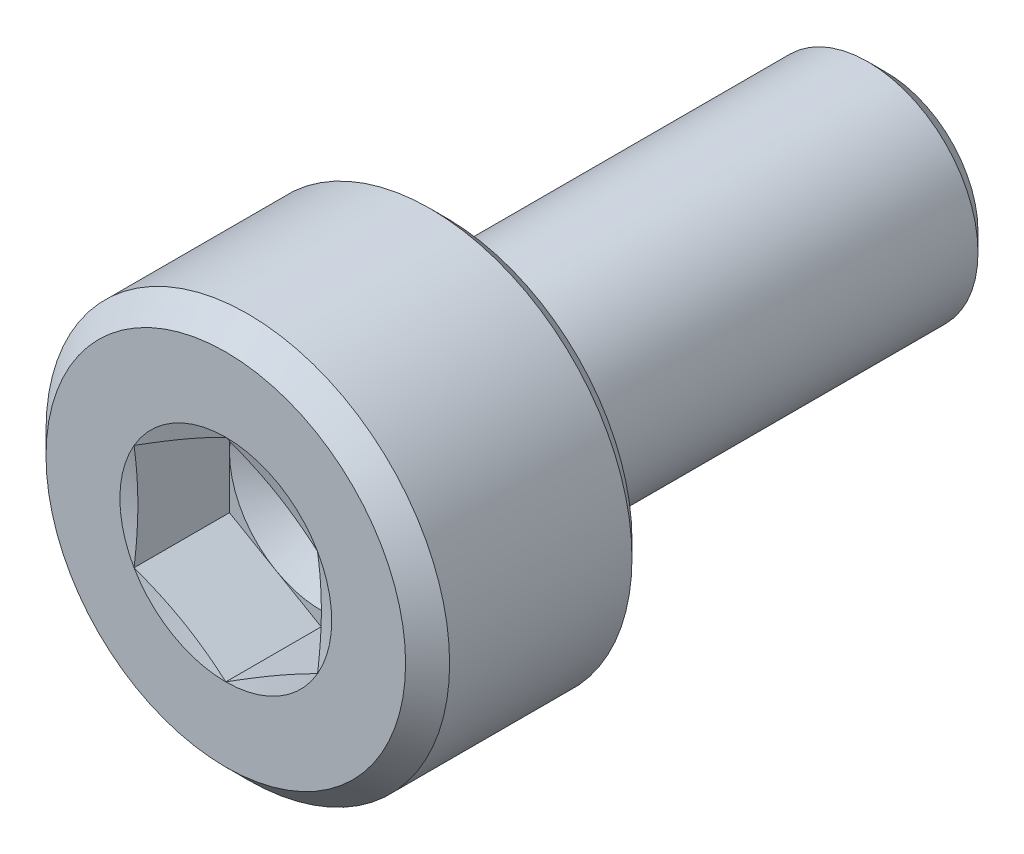
ISO-10303-21;
HEADER;
FILE_DESCRIPTION(('STEP AP214'),'2;1');
FILE_NAME('part.step','',(''),(''),'','','');
FILE_SCHEMA(('AUTOMOTIVE_DESIGN { 1 0 10303 214 1 1 1 1 }'));
ENDSEC;
DATA;
#1=APPLICATION_CONTEXT('core data for automotive mechanical design processes');
#2=APPLICATION_PROTOCOL_DEFINITION('international standard','automotive_design',2000,#1);
#3=PRODUCT_CONTEXT('',#1,'mechanical');
#4=PRODUCT('Part','Part','',(#3));
#5=PRODUCT_RELATED_PRODUCT_CATEGORY('part','',(#4));
#6=PRODUCT_DEFINITION_FORMATION('','',#4);
#7=PRODUCT_DEFINITION_CONTEXT('part definition',#1,'design');
#8=PRODUCT_DEFINITION('design','',#6,#7);
#9=PRODUCT_DEFINITION_SHAPE('','',#8);
#10=(LENGTH_UNIT() NAMED_UNIT(*) SI_UNIT(.MILLI.,.METRE.));
#11=(NAMED_UNIT(*) PLANE_ANGLE_UNIT() SI_UNIT($,.RADIAN.));
#12=(NAMED_UNIT(*) SI_UNIT($,.STERADIAN.) SOLID_ANGLE_UNIT());
#13=UNCERTAINTY_MEASURE_WITH_UNIT(LENGTH_MEASURE(1.E-05),#10,'distance_accuracy_value','');
#14=(GEOMETRIC_REPRESENTATION_CONTEXT(3) GLOBAL_UNCERTAINTY_ASSIGNED_CONTEXT((#13)) GLOBAL_UNIT_ASSIGNED_CONTEXT((#10,
#11,#12)) REPRESENTATION_CONTEXT('',''));
#15=CARTESIAN_POINT('',(0.,0.,0.));
#16=DIRECTION('',(0.,0.,1.));
#17=DIRECTION('',(1.,0.,0.));
#18=AXIS2_PLACEMENT_3D('',#15,#16,#17);
#19=CARTESIAN_POINT('',(0.,0.,0.));
#20=DIRECTION('',(0.,0.,-1.));
#21=DIRECTION('',(-1.,0.,0.));
#22=AXIS2_PLACEMENT_3D('',#19,#20,#21);
#23=PLANE('',#22);
#24=CARTESIAN_POINT('',(0.,0.,0.));
#25=DIRECTION('',(0.,0.,1.));
#26=DIRECTION('',(1.,0.,0.));
#27=AXIS2_PLACEMENT_3D('',#24,#25,#26);
#28=CIRCLE('',#27,2.44999999999999);
#29=CARTESIAN_POINT('',(2.44999999999999,0.,0.));
#30=VERTEX_POINT('',#29);
#31=EDGE_CURVE('E228',#30,#30,#28,.T.);
#32=ORIENTED_EDGE('',*,*,#31,.T.);
#33=EDGE_LOOP('',(#32));
#34=FACE_BOUND('',#33,.T.);
#35=CARTESIAN_POINT('',(0.,0.,0.));
#36=DIRECTION('',(0.,0.,1.));
#37=DIRECTION('',(1.,0.,0.));
#38=AXIS2_PLACEMENT_3D('',#35,#36,#37);
#39=CIRCLE('',#38,1.44337567297407);
#40=CARTESIAN_POINT('',(-1.25,-0.721687836487033,0.));
#41=VERTEX_POINT('',#40);
#42=CARTESIAN_POINT('',(0.,-1.44337567297407,0.));
#43=VERTEX_POINT('',#42);
#44=EDGE_CURVE('E154',#41,#43,#39,.T.);
#45=ORIENTED_EDGE('',*,*,#44,.F.);
#46=CARTESIAN_POINT('',(-1.25,0.721687836487033,0.));
#47=VERTEX_POINT('',#46);
#48=EDGE_CURVE('E153',#47,#41,#39,.T.);
#49=ORIENTED_EDGE('',*,*,#48,.F.);
#50=CARTESIAN_POINT('',(0.,1.44337567297407,0.));
#51=VERTEX_POINT('',#50);
#52=EDGE_CURVE('E120',#51,#47,#39,.T.);
#53=ORIENTED_EDGE('',*,*,#52,.F.);
#54=CARTESIAN_POINT('',(1.25,0.721687836487034,0.));
#55=VERTEX_POINT('',#54);
#56=EDGE_CURVE('E114',#55,#51,#39,.T.);
#57=ORIENTED_EDGE('',*,*,#56,.F.);
#58=CARTESIAN_POINT('',(1.25,-0.721687836487031,0.));
#59=VERTEX_POINT('',#58);
#60=EDGE_CURVE('E122',#59,#55,#39,.T.);
#61=ORIENTED_EDGE('',*,*,#60,.F.);
#62=EDGE_CURVE('E312',#43,#59,#39,.T.);
#63=ORIENTED_EDGE('',*,*,#62,.F.);
#64=EDGE_LOOP('',(#45,#49,#53,#57,#61,#63));
#65=FACE_BOUND('',#64,.T.);
#66=ADVANCED_FACE('F37',(#34,#65),#23,.F.);
#67=CARTESIAN_POINT('',(0.,0.,-0.3));
#68=DIRECTION('',(0.,0.,-1.));
#69=DIRECTION('',(-1.,0.,0.));
#70=AXIS2_PLACEMENT_3D('',#67,#68,#69);
#71=CONICAL_SURFACE('',#70,2.75,0.78539816339746);
#72=ORIENTED_EDGE('',*,*,#31,.F.);
#73=EDGE_LOOP('',(#72));
#74=FACE_BOUND('',#73,.T.);
#75=CARTESIAN_POINT('',(0.,0.,-0.3));
#76=DIRECTION('',(0.,0.,1.));
#77=DIRECTION('',(1.,0.,0.));
#78=AXIS2_PLACEMENT_3D('',#75,#76,#77);
#79=CIRCLE('',#78,2.75);
#80=CARTESIAN_POINT('',(2.75,0.,-0.3));
#81=VERTEX_POINT('',#80);
#82=EDGE_CURVE('E230',#81,#81,#79,.T.);
#83=ORIENTED_EDGE('',*,*,#82,.T.);
#84=EDGE_LOOP('',(#83));
#85=FACE_BOUND('',#84,.T.);
#86=ADVANCED_FACE('F219',(#74,#85),#71,.T.);
#87=CARTESIAN_POINT('',(0.,0.,0.));
#88=DIRECTION('',(0.,0.,1.));
#89=DIRECTION('',(1.,0.,0.));
#90=AXIS2_PLACEMENT_3D('',#87,#88,#89);
#91=CYLINDRICAL_SURFACE('',#90,2.75);
#92=ORIENTED_EDGE('',*,*,#82,.F.);
#93=EDGE_LOOP('',(#92));
#94=FACE_BOUND('',#93,.T.);
#95=CARTESIAN_POINT('',(0.,0.,-2.785));
#96=DIRECTION('',(0.,0.,1.));
#97=DIRECTION('',(1.,0.,0.));
#98=AXIS2_PLACEMENT_3D('',#95,#96,#97);
#99=CIRCLE('',#98,2.75);
#100=CARTESIAN_POINT('',(2.75,0.,-2.785));
#101=VERTEX_POINT('',#100);
#102=EDGE_CURVE('E233',#101,#101,#99,.T.);
#103=ORIENTED_EDGE('',*,*,#102,.T.);
#104=EDGE_LOOP('',(#103));
#105=FACE_BOUND('',#104,.T.);
#106=ADVANCED_FACE('F224',(#94,#105),#91,.T.);
#107=CARTESIAN_POINT('',(0.,0.,-3.));
#108=DIRECTION('',(0.,0.,1.));
#109=DIRECTION('',(1.,0.,0.));
#110=AXIS2_PLACEMENT_3D('',#107,#108,#109);
#111=CONICAL_SURFACE('',#110,2.535,0.785398163397449);
#112=ORIENTED_EDGE('',*,*,#102,.F.);
#113=EDGE_LOOP('',(#112));
#114=FACE_BOUND('',#113,.T.);
#115=CARTESIAN_POINT('',(0.,0.,-3.));
#116=DIRECTION('',(0.,0.,1.));
#117=DIRECTION('',(1.,0.,0.));
#118=AXIS2_PLACEMENT_3D('',#115,#116,#117);
#119=CIRCLE('',#118,2.535);
#120=CARTESIAN_POINT('',(2.535,0.,-3.));
#121=VERTEX_POINT('',#120);
#122=EDGE_CURVE('E238',#121,#121,#119,.T.);
#123=ORIENTED_EDGE('',*,*,#122,.T.);
#124=EDGE_LOOP('',(#123));
#125=FACE_BOUND('',#124,.T.);
#126=ADVANCED_FACE('F428',(#114,#125),#111,.T.);
#127=CARTESIAN_POINT('',(0.,2.535,-3.));
#128=DIRECTION('',(0.,0.,1.));
#129=DIRECTION('',(1.,0.,0.));
#130=AXIS2_PLACEMENT_3D('',#127,#128,#129);
#131=PLANE('',#130);
#132=ORIENTED_EDGE('',*,*,#122,.F.);
#133=EDGE_LOOP('',(#132));
#134=FACE_BOUND('',#133,.T.);
#135=CARTESIAN_POINT('',(0.,0.,-3.));
#136=DIRECTION('',(0.,0.,1.));
#137=DIRECTION('',(1.,0.,0.));
#138=AXIS2_PLACEMENT_3D('',#135,#136,#137);
#139=CIRCLE('',#138,1.8);
#140=CARTESIAN_POINT('',(1.8,0.,-3.));
#141=VERTEX_POINT('',#140);
#142=EDGE_CURVE('E241',#141,#141,#139,.T.);
#143=ORIENTED_EDGE('',*,*,#142,.T.);
#144=EDGE_LOOP('',(#143));
#145=FACE_BOUND('',#144,.T.);
#146=ADVANCED_FACE('F420',(#134,#145),#131,.F.);
#147=CARTESIAN_POINT('',(0.,0.,-3.1));
#148=DIRECTION('',(0.,0.,1.));
#149=DIRECTION('',(1.,0.,0.));
#150=AXIS2_PLACEMENT_3D('',#147,#148,#149);
#151=TOROIDAL_SURFACE('',#150,1.8,0.1);
#152=ORIENTED_EDGE('',*,*,#142,.F.);
#153=EDGE_LOOP('',(#152));
#154=FACE_BOUND('',#153,.T.);
#155=CARTESIAN_POINT('',(0.,0.,-3.05615763679786));
#156=DIRECTION('',(0.,0.,1.));
#157=DIRECTION('',(1.,0.,0.));
#158=AXIS2_PLACEMENT_3D('',#155,#156,#157);
#159=CIRCLE('',#158,1.71012315543561);
#160=CARTESIAN_POINT('',(1.71012315543561,0.,-3.05615763679786));
#161=VERTEX_POINT('',#160);
#162=EDGE_CURVE('E244',#161,#161,#159,.T.);
#163=ORIENTED_EDGE('',*,*,#162,.T.);
#164=EDGE_LOOP('',(#163));
#165=FACE_BOUND('',#164,.T.);
#166=ADVANCED_FACE('F412',(#154,#165),#151,.F.);
#167=CARTESIAN_POINT('',(0.,0.,-3.46615763679786));
#168=DIRECTION('',(0.,0.,1.));
#169=DIRECTION('',(1.,0.,0.));
#170=AXIS2_PLACEMENT_3D('',#167,#168,#169);
#171=CONICAL_SURFACE('',#170,1.51012315543561,0.453844001521511);
#172=ORIENTED_EDGE('',*,*,#162,.F.);
#173=EDGE_LOOP('',(#172));
#174=FACE_BOUND('',#173,.T.);
#175=CARTESIAN_POINT('',(0.,0.,-3.46615763679786));
#176=DIRECTION('',(0.,0.,1.));
#177=DIRECTION('',(1.,0.,0.));
#178=AXIS2_PLACEMENT_3D('',#175,#176,#177);
#179=CIRCLE('',#178,1.51012315543561);
#180=CARTESIAN_POINT('',(1.51012315543561,0.,-3.46615763679786));
#181=VERTEX_POINT('',#180);
#182=EDGE_CURVE('E247',#181,#181,#179,.T.);
#183=ORIENTED_EDGE('',*,*,#182,.T.);
#184=EDGE_LOOP('',(#183));
#185=FACE_BOUND('',#184,.T.);
#186=ADVANCED_FACE('F404',(#174,#185),#171,.T.);
#187=CARTESIAN_POINT('',(0.,0.,-3.51));
#188=DIRECTION('',(0.,0.,1.));
#189=DIRECTION('',(1.,0.,0.));
#190=AXIS2_PLACEMENT_3D('',#187,#188,#189);
#191=TOROIDAL_SURFACE('',#190,1.6,0.1);
#192=ORIENTED_EDGE('',*,*,#182,.F.);
#193=EDGE_LOOP('',(#192));
#194=FACE_BOUND('',#193,.T.);
#195=CARTESIAN_POINT('',(0.,0.,-3.51));
#196=DIRECTION('',(0.,0.,1.));
#197=DIRECTION('',(1.,0.,0.));
#198=AXIS2_PLACEMENT_3D('',#195,#196,#197);
#199=CIRCLE('',#198,1.5);
#200=CARTESIAN_POINT('',(1.5,0.,-3.51));
#201=VERTEX_POINT('',#200);
#202=EDGE_CURVE('E250',#201,#201,#199,.T.);
#203=ORIENTED_EDGE('',*,*,#202,.T.);
#204=EDGE_LOOP('',(#203));
#205=FACE_BOUND('',#204,.T.);
#206=ADVANCED_FACE('F396',(#194,#205),#191,.F.);
#207=CARTESIAN_POINT('',(0.,0.,0.));
#208=DIRECTION('',(0.,0.,1.));
#209=DIRECTION('',(1.,0.,0.));
#210=AXIS2_PLACEMENT_3D('',#207,#208,#209);
#211=CYLINDRICAL_SURFACE('',#210,1.5);
#212=ORIENTED_EDGE('',*,*,#202,.F.);
#213=EDGE_LOOP('',(#212));
#214=FACE_BOUND('',#213,.T.);
#215=CARTESIAN_POINT('',(0.,0.,-8.75));
#216=DIRECTION('',(0.,0.,1.));
#217=DIRECTION('',(1.,0.,0.));
#218=AXIS2_PLACEMENT_3D('',#215,#216,#217);
#219=CIRCLE('',#218,1.5);
#220=CARTESIAN_POINT('',(1.5,0.,-8.75));
#221=VERTEX_POINT('',#220);
#222=EDGE_CURVE('E253',#221,#221,#219,.T.);
#223=ORIENTED_EDGE('',*,*,#222,.T.);
#224=EDGE_LOOP('',(#223));
#225=FACE_BOUND('',#224,.T.);
#226=ADVANCED_FACE('F387',(#214,#225),#211,.T.);
#227=CARTESIAN_POINT('',(0.,0.,-9.));
#228=DIRECTION('',(0.,0.,1.));
#229=DIRECTION('',(1.,0.,0.));
#230=AXIS2_PLACEMENT_3D('',#227,#228,#229);
#231=CONICAL_SURFACE('',#230,1.25,0.785398163397438);
#232=ORIENTED_EDGE('',*,*,#222,.F.);
#233=EDGE_LOOP('',(#232));
#234=FACE_BOUND('',#233,.T.);
#235=CARTESIAN_POINT('',(0.,0.,-9.));
#236=DIRECTION('',(0.,0.,1.));
#237=DIRECTION('',(1.,0.,0.));
#238=AXIS2_PLACEMENT_3D('',#235,#236,#237);
#239=CIRCLE('',#238,1.25);
#240=CARTESIAN_POINT('',(1.25,0.,-9.));
#241=VERTEX_POINT('',#240);
#242=EDGE_CURVE('E256',#241,#241,#239,.T.);
#243=ORIENTED_EDGE('',*,*,#242,.T.);
#244=EDGE_LOOP('',(#243));
#245=FACE_BOUND('',#244,.T.);
#246=ADVANCED_FACE('F379',(#234,#245),#231,.T.);
#247=CARTESIAN_POINT('',(0.,1.25,-9.));
#248=DIRECTION('',(0.,0.,1.));
#249=DIRECTION('',(1.,0.,0.));
#250=AXIS2_PLACEMENT_3D('',#247,#248,#249);
#251=PLANE('',#250);
#252=ORIENTED_EDGE('',*,*,#242,.F.);
#253=EDGE_LOOP('',(#252));
#254=FACE_BOUND('',#253,.T.);
#255=ADVANCED_FACE('F373',(#254),#251,.F.);
#256=CARTESIAN_POINT('',(0.,0.,-0.0518148554092243));
#257=DIRECTION('',(0.,0.,1.));
#258=DIRECTION('',(1.,0.,0.));
#259=AXIS2_PLACEMENT_3D('',#256,#257,#258);
#260=CONICAL_SURFACE('',#259,1.25,1.30899693899575);
#261=ORIENTED_EDGE('',*,*,#52,.T.);
#262=CARTESIAN_POINT('',(-1.2502,0.721572366433195,3.09438201916871E-05));
#263=CARTESIAN_POINT('',(-1.19827409383526,0.751551802335321,-0.00800698378926622));
#264=CARTESIAN_POINT('',(-1.14625401362102,0.781585609650283,-0.0153042105125454));
#265=CARTESIAN_POINT('',(-1.04203006351459,0.841759335300235,-0.0281248924452036));
#266=CARTESIAN_POINT('',(-0.989826127596593,0.871899291755248,-0.0336476265269101));
#267=CARTESIAN_POINT('',(-0.88555111655682,0.932102497448812,-0.0425967858491088));
#268=CARTESIAN_POINT('',(-0.833480747184869,0.962165339222511,-0.0460338877791617));
#269=CARTESIAN_POINT('',(-0.729273575326724,1.0223293779463,-0.0506427032068));
#270=CARTESIAN_POINT('',(-0.677136787663362,1.05243056633842,-0.0518148554092241));
#271=CARTESIAN_POINT('',(-0.572863212336638,1.11263294312267,-0.0518148554092241));
#272=CARTESIAN_POINT('',(-0.520726424673275,1.1427341315148,-0.0506427032068001));
#273=CARTESIAN_POINT('',(-0.416519252815131,1.20289817023859,-0.0460338877791617));
#274=CARTESIAN_POINT('',(-0.36444888344318,1.23296101201229,-0.0425967858491088));
#275=CARTESIAN_POINT('',(-0.260173872403407,1.29316421770585,-0.03364762652691));
#276=CARTESIAN_POINT('',(-0.207969936485411,1.32330417416086,-0.0281248924452036));
#277=CARTESIAN_POINT('',(-0.103745986378985,1.38347789981082,-0.0153042105125453));
#278=CARTESIAN_POINT('',(-0.0517259061647358,1.41351170712578,-0.00800698378926612));
#279=CARTESIAN_POINT('',(0.00020000000000038,1.4434911430279,3.09438201918299E-05));
#280=B_SPLINE_CURVE_WITH_KNOTS('',3,(#262,#263,#264,#265,#266,#267,#268,#269,#270,#271,#272,
#273,#274,#275,#276,#277,#278,#279),.UNSPECIFIED.,.F.,.F.,(4,2,2,2,2,2,2,2,4),(0.,
0.18149525192516,0.363064167833313,0.543695584294992,0.724292010212745,0.9048884361305,
1.08551985259218,1.26708876850033,1.44858402042549),.UNSPECIFIED.);
#281=EDGE_CURVE('E11',#47,#51,#280,.T.);
#282=ORIENTED_EDGE('',*,*,#281,.T.);
#283=EDGE_LOOP('',(#261,#282));
#284=FACE_BOUND('',#283,.T.);
#285=ADVANCED_FACE('F126',(#284),#260,.F.);
#286=CARTESIAN_POINT('',(-1.25,-1.90803764372689,0.224449375411132));
#287=CARTESIAN_POINT('',(-1.25,-1.8513410457493,0.21174373926854));
#288=CARTESIAN_POINT('',(-1.25,-1.79460907964503,0.199195804458375));
#289=CARTESIAN_POINT('',(-1.25,-1.68105673477474,0.174495010900465));
#290=CARTESIAN_POINT('',(-1.25,-1.62423635229394,0.162342169249333));
#291=CARTESIAN_POINT('',(-1.25,-1.4535135757121,0.126574423752231));
#292=CARTESIAN_POINT('',(-1.25,-1.33945900339908,0.103675151182616));
#293=CARTESIAN_POINT('',(-1.25,-1.11170727260793,0.0609587630346281));
#294=CARTESIAN_POINT('',(-1.25,-0.998014548362105,0.0411184667683871));
#295=CARTESIAN_POINT('',(-1.25,-0.769948454688276,0.00583266905587686));
#296=CARTESIAN_POINT('',(-1.25,-0.655575207287998,-0.00961359741797872));
#297=CARTESIAN_POINT('',(-1.25,-0.424787181644499,-0.0341426384914952));
#298=CARTESIAN_POINT('',(-1.25,-0.308363938645654,-0.0431515305449703));
#299=CARTESIAN_POINT('',(-1.25,-0.133499226938177,-0.0502674214127566));
#300=CARTESIAN_POINT('',(-1.25,-0.0751823293286765,-0.0515734559811251));
#301=CARTESIAN_POINT('',(-1.25,0.0414593912908041,-0.0519953132862497));
#302=CARTESIAN_POINT('',(-1.25,0.0997842142946219,-0.0511111377164467));
#303=CARTESIAN_POINT('',(-1.25,0.275064939261687,-0.0452058780708578));
#304=CARTESIAN_POINT('',(-1.25,0.391917619612776,-0.0369155048717787));
#305=CARTESIAN_POINT('',(-1.25,0.624955711707257,-0.013420604100275));
#306=CARTESIAN_POINT('',(-1.25,0.741140574853819,0.00178895996036897));
#307=CARTESIAN_POINT('',(-1.25,0.965009686747211,0.0357098573203466));
#308=CARTESIAN_POINT('',(-1.25,1.07274149713457,0.0541179629895213));
#309=CARTESIAN_POINT('',(-1.25,1.28770836040789,0.0936619087242774));
#310=CARTESIAN_POINT('',(-1.25,1.39494334881407,0.114798093117207));
#311=CARTESIAN_POINT('',(-1.25,1.60905523406172,0.158897571848756));
#312=CARTESIAN_POINT('',(-1.25,1.71593205434096,0.181861233731142));
#313=CARTESIAN_POINT('',(-1.25,1.92941059122614,0.229035853527515));
#314=CARTESIAN_POINT('',(-1.25,2.0360123020935,0.253246837242345));
#315=CARTESIAN_POINT('',(-1.25,2.24796149236902,0.302300913060499));
#316=CARTESIAN_POINT('',(-1.25,2.35331096915779,0.32713541151495));
#317=CARTESIAN_POINT('',(-1.25,2.56386296226419,0.377426560036597));
#318=CARTESIAN_POINT('',(-1.25,2.66906547587909,0.402883221390532));
#319=CARTESIAN_POINT('',(-1.25,2.87922866754162,0.454224569867166));
#320=CARTESIAN_POINT('',(-1.25,2.98418948388924,0.4801086920956));
#321=CARTESIAN_POINT('',(-1.25,3.19401964928918,0.53223064686748));
#322=CARTESIAN_POINT('',(-1.25,3.29888900123911,0.558468467737611));
#323=CARTESIAN_POINT('',(-1.25,3.40372646605654,0.5848316076134));
#324=B_SPLINE_CURVE_WITH_KNOTS('',3,(#286,#287,#288,#289,#290,#291,#292,#293,#294,#295,#296,
#297,#298,#299,#300,#301,#302,#303,#304,#305,#306,#307,#308,#309,#310,#311,#312,#313,#314,#315,
#316,#317,#318,#319,#320,#321,#322,#323),.UNSPECIFIED.,.F.,.F.,(4,2,2,2,2,2,2,2,2,2,2,2,2,2,2,2,
2,2,4),(0.,0.17430798332962,0.348623499364559,0.697591208701206,1.04376859165833,
1.38988566606611,1.73991400543005,1.91487041156219,2.08982668242046,2.44096537417444,
2.79236007022679,3.12019018011378,3.44806170796195,3.77599934506425,4.10394376827983,
4.4286525086615,4.75336714400545,5.07768244044904,5.40198705941089),.UNSPECIFIED.);
#325=EDGE_CURVE('E119',#41,#47,#324,.T.);
#326=ORIENTED_EDGE('',*,*,#325,.T.);
#327=ORIENTED_EDGE('',*,*,#48,.T.);
#328=EDGE_LOOP('',(#326,#327));
#329=FACE_BOUND('',#328,.T.);
#330=ADVANCED_FACE('F360',(#329),#260,.F.);
#331=CARTESIAN_POINT('',(0.000199999999999765,-1.4434911430279,3.09438201913897E-05));
#332=CARTESIAN_POINT('',(-0.0517259061647364,-1.41351170712578,-0.0080069837892665));
#333=CARTESIAN_POINT('',(-0.103745986378985,-1.38347789981081,-0.0153042105125457));
#334=CARTESIAN_POINT('',(-0.207969936485412,-1.32330417416086,-0.028124892445204));
#335=CARTESIAN_POINT('',(-0.260173872403408,-1.29316421770585,-0.0336476265269104));
#336=CARTESIAN_POINT('',(-0.36444888344318,-1.23296101201229,-0.0425967858491091));
#337=CARTESIAN_POINT('',(-0.416519252815131,-1.20289817023859,-0.046033887779162));
#338=CARTESIAN_POINT('',(-0.520726424673276,-1.1427341315148,-0.0506427032068003));
#339=CARTESIAN_POINT('',(-0.572863212336638,-1.11263294312267,-0.0518148554092244));
#340=CARTESIAN_POINT('',(-0.677136787663362,-1.05243056633842,-0.0518148554092244));
#341=CARTESIAN_POINT('',(-0.729273575326725,-1.0223293779463,-0.0506427032068003));
#342=CARTESIAN_POINT('',(-0.833480747184869,-0.962165339222509,-0.046033887779162));
#343=CARTESIAN_POINT('',(-0.88555111655682,-0.93210249744881,-0.0425967858491091));
#344=CARTESIAN_POINT('',(-0.989826127596593,-0.871899291755246,-0.0336476265269103));
#345=CARTESIAN_POINT('',(-1.04203006351459,-0.841759335300233,-0.0281248924452038));
#346=CARTESIAN_POINT('',(-1.14625401362102,-0.781585609650282,-0.0153042105125455));
#347=CARTESIAN_POINT('',(-1.19827409383526,-0.75155180233532,-0.00800698378926632));
#348=CARTESIAN_POINT('',(-1.2502,-0.721572366433194,3.09438201915463E-05));
#349=B_SPLINE_CURVE_WITH_KNOTS('',3,(#331,#332,#333,#334,#335,#336,#337,#338,#339,#340,#341,
#342,#343,#344,#345,#346,#347,#348),.UNSPECIFIED.,.F.,.F.,(4,2,2,2,2,2,2,2,4),(0.,
0.18149525192516,0.363064167833313,0.543695584294991,0.724292010212745,0.904888436130499,
1.08551985259218,1.26708876850033,1.44858402042549),.UNSPECIFIED.);
#350=EDGE_CURVE('E162',#43,#41,#349,.T.);
#351=ORIENTED_EDGE('',*,*,#350,.T.);
#352=ORIENTED_EDGE('',*,*,#44,.T.);
#353=EDGE_LOOP('',(#351,#352));
#354=FACE_BOUND('',#353,.T.);
#355=ADVANCED_FACE('F354',(#354),#260,.F.);
#356=CARTESIAN_POINT('',(1.2502,-0.721572366433195,3.09438201914613E-05));
#357=CARTESIAN_POINT('',(1.19827409383526,-0.75155180233532,-0.00800698378926647));
#358=CARTESIAN_POINT('',(1.14625401362101,-0.781585609650283,-0.0153042105125457));
#359=CARTESIAN_POINT('',(1.04203006351459,-0.841759335300234,-0.0281248924452039));
#360=CARTESIAN_POINT('',(0.989826127596592,-0.871899291755247,-0.0336476265269103));
#361=CARTESIAN_POINT('',(0.88555111655682,-0.932102497448811,-0.042596785849109));
#362=CARTESIAN_POINT('',(0.833480747184869,-0.96216533922251,-0.046033887779162));
#363=CARTESIAN_POINT('',(0.729273575326724,-1.0223293779463,-0.0506427032068003));
#364=CARTESIAN_POINT('',(0.677136787663362,-1.05243056633842,-0.0518148554092244));
#365=CARTESIAN_POINT('',(0.572863212336637,-1.11263294312267,-0.0518148554092244));
#366=CARTESIAN_POINT('',(0.520726424673275,-1.1427341315148,-0.0506427032068003));
#367=CARTESIAN_POINT('',(0.416519252815131,-1.20289817023859,-0.046033887779162));
#368=CARTESIAN_POINT('',(0.36444888344318,-1.23296101201229,-0.042596785849109));
#369=CARTESIAN_POINT('',(0.260173872403407,-1.29316421770585,-0.0336476265269103));
#370=CARTESIAN_POINT('',(0.207969936485411,-1.32330417416086,-0.028124892445204));
#371=CARTESIAN_POINT('',(0.103745986378985,-1.38347789981081,-0.0153042105125458));
#372=CARTESIAN_POINT('',(0.0517259061647362,-1.41351170712578,-0.00800698378926656));
#373=CARTESIAN_POINT('',(-0.000200000000000036,-1.4434911430279,3.09438201914066E-05));
#374=B_SPLINE_CURVE_WITH_KNOTS('',3,(#356,#357,#358,#359,#360,#361,#362,#363,#364,#365,#366,
#367,#368,#369,#370,#371,#372,#373),.UNSPECIFIED.,.F.,.F.,(4,2,2,2,2,2,2,2,4),(0.,
0.18149525192516,0.363064167833312,0.543695584294991,0.724292010212745,0.904888436130499,
1.08551985259218,1.26708876850033,1.44858402042549),.UNSPECIFIED.);
#375=EDGE_CURVE('E182',#59,#43,#374,.T.);
#376=ORIENTED_EDGE('',*,*,#375,.T.);
#377=ORIENTED_EDGE('',*,*,#62,.T.);
#378=EDGE_LOOP('',(#376,#377));
#379=FACE_BOUND('',#378,.T.);
#380=ADVANCED_FACE('F348',(#379),#260,.F.);
#381=CARTESIAN_POINT('',(1.25,-1.90803764372689,0.224449375411132));
#382=CARTESIAN_POINT('',(1.25,-1.8513410457493,0.21174373926854));
#383=CARTESIAN_POINT('',(1.25,-1.79460907964503,0.199195804458375));
#384=CARTESIAN_POINT('',(1.25,-1.68105673477474,0.174495010900465));
#385=CARTESIAN_POINT('',(1.25,-1.62423635229394,0.162342169249333));
#386=CARTESIAN_POINT('',(1.25,-1.4535135757121,0.126574423752231));
#387=CARTESIAN_POINT('',(1.25,-1.33945900339908,0.103675151182616));
#388=CARTESIAN_POINT('',(1.25,-1.11170727260793,0.0609587630346278));
#389=CARTESIAN_POINT('',(1.25,-0.998014548362105,0.0411184667683869));
#390=CARTESIAN_POINT('',(1.25,-0.769948454688276,0.00583266905587672));
#391=CARTESIAN_POINT('',(1.25,-0.655575207287999,-0.00961359741797884));
#392=CARTESIAN_POINT('',(1.25,-0.4247871816445,-0.0341426384914953));
#393=CARTESIAN_POINT('',(1.25,-0.308363938645655,-0.0431515305449704));
#394=CARTESIAN_POINT('',(1.25,-0.133499226938178,-0.0502674214127568));
#395=CARTESIAN_POINT('',(1.25,-0.0751823293286781,-0.0515734559811252));
#396=CARTESIAN_POINT('',(1.25,0.0414593912908024,-0.0519953132862499));
#397=CARTESIAN_POINT('',(1.25,0.0997842142946203,-0.0511111377164469));
#398=CARTESIAN_POINT('',(1.25,0.275064939261685,-0.045205878070858));
#399=CARTESIAN_POINT('',(1.25,0.391917619612775,-0.036915504871779));
#400=CARTESIAN_POINT('',(1.25,0.624955711707256,-0.0134206041002753));
#401=CARTESIAN_POINT('',(1.25,0.741140574853817,0.00178895996036867));
#402=CARTESIAN_POINT('',(1.25,0.96500968674721,0.0357098573203462));
#403=CARTESIAN_POINT('',(1.25,1.07274149713457,0.054117962989521));
#404=CARTESIAN_POINT('',(1.25,1.28770836040789,0.093661908724277));
#405=CARTESIAN_POINT('',(1.25,1.39494334881407,0.114798093117207));
#406=CARTESIAN_POINT('',(1.25,1.60905523406172,0.158897571848756));
#407=CARTESIAN_POINT('',(1.25,1.71593205434096,0.181861233731142));
#408=CARTESIAN_POINT('',(1.25,1.92941059122614,0.229035853527516));
#409=CARTESIAN_POINT('',(1.25,2.0360123020935,0.253246837242345));
#410=CARTESIAN_POINT('',(1.25,2.24796149236902,0.302300913060499));
#411=CARTESIAN_POINT('',(1.25,2.35331096915779,0.32713541151495));
#412=CARTESIAN_POINT('',(1.25,2.56386296226419,0.377426560036597));
#413=CARTESIAN_POINT('',(1.25,2.66906547587909,0.402883221390532));
#414=CARTESIAN_POINT('',(1.25,2.87922866754162,0.454224569867166));
#415=CARTESIAN_POINT('',(1.25,2.98418948388924,0.4801086920956));
#416=CARTESIAN_POINT('',(1.25,3.19401964928918,0.53223064686748));
#417=CARTESIAN_POINT('',(1.25,3.29888900123911,0.558468467737611));
#418=CARTESIAN_POINT('',(1.25,3.40372646605654,0.5848316076134));
#419=B_SPLINE_CURVE_WITH_KNOTS('',3,(#381,#382,#383,#384,#385,#386,#387,#388,#389,#390,#391,
#392,#393,#394,#395,#396,#397,#398,#399,#400,#401,#402,#403,#404,#405,#406,#407,#408,#409,#410,
#411,#412,#413,#414,#415,#416,#417,#418),.UNSPECIFIED.,.F.,.F.,(4,2,2,2,2,2,2,2,2,2,2,2,2,2,2,2,
2,2,4),(0.,0.17430798332962,0.348623499364559,0.697591208701206,1.04376859165833,
1.38988566606611,1.73991400543005,1.91487041156219,2.08982668242046,2.44096537417444,
2.79236007022679,3.12019018011378,3.44806170796195,3.77599934506425,4.10394376827983,
4.4286525086615,4.75336714400545,5.07768244044904,5.40198705941089),.UNSPECIFIED.);
#420=EDGE_CURVE('E62',#55,#59,#419,.F.);
#421=ORIENTED_EDGE('',*,*,#420,.T.);
#422=ORIENTED_EDGE('',*,*,#60,.T.);
#423=EDGE_LOOP('',(#421,#422));
#424=FACE_BOUND('',#423,.T.);
#425=ADVANCED_FACE('F175',(#424),#260,.F.);
#426=CARTESIAN_POINT('',(-0.000199999999999885,1.4434911430279,3.09438201917452E-05));
#427=CARTESIAN_POINT('',(0.0517259061647365,1.41351170712578,-0.00800698378926616));
#428=CARTESIAN_POINT('',(0.103745986378985,1.38347789981081,-0.0153042105125454));
#429=CARTESIAN_POINT('',(0.207969936485411,1.32330417416086,-0.0281248924452036));
#430=CARTESIAN_POINT('',(0.260173872403408,1.29316421770585,-0.03364762652691));
#431=CARTESIAN_POINT('',(0.36444888344318,1.23296101201229,-0.0425967858491087));
#432=CARTESIAN_POINT('',(0.416519252815131,1.20289817023859,-0.0460338877791617));
#433=CARTESIAN_POINT('',(0.520726424673275,1.1427341315148,-0.0506427032068));
#434=CARTESIAN_POINT('',(0.572863212336638,1.11263294312267,-0.0518148554092241));
#435=CARTESIAN_POINT('',(0.677136787663362,1.05243056633842,-0.0518148554092242));
#436=CARTESIAN_POINT('',(0.729273575326724,1.0223293779463,-0.0506427032068001));
#437=CARTESIAN_POINT('',(0.833480747184869,0.962165339222511,-0.0460338877791617));
#438=CARTESIAN_POINT('',(0.88555111655682,0.932102497448812,-0.0425967858491088));
#439=CARTESIAN_POINT('',(0.989826127596592,0.871899291755248,-0.0336476265269101));
#440=CARTESIAN_POINT('',(1.04203006351459,0.841759335300235,-0.0281248924452037));
#441=CARTESIAN_POINT('',(1.14625401362101,0.781585609650283,-0.0153042105125454));
#442=CARTESIAN_POINT('',(1.19827409383526,0.751551802335321,-0.00800698378926624));
#443=CARTESIAN_POINT('',(1.2502,0.721572366433195,3.09438201916591E-05));
#444=B_SPLINE_CURVE_WITH_KNOTS('',3,(#426,#427,#428,#429,#430,#431,#432,#433,#434,#435,#436,
#437,#438,#439,#440,#441,#442,#443),.UNSPECIFIED.,.F.,.F.,(4,2,2,2,2,2,2,2,4),(0.,
0.18149525192516,0.363064167833313,0.543695584294991,0.724292010212745,0.904888436130499,
1.08551985259218,1.26708876850033,1.44858402042549),.UNSPECIFIED.);
#445=EDGE_CURVE('E56',#51,#55,#444,.T.);
#446=ORIENTED_EDGE('',*,*,#445,.T.);
#447=ORIENTED_EDGE('',*,*,#56,.T.);
#448=EDGE_LOOP('',(#446,#447));
#449=FACE_BOUND('',#448,.T.);
#450=ADVANCED_FACE('F115',(#449),#260,.F.);
#451=CARTESIAN_POINT('',(0.,0.,-2.02168783648703));
#452=DIRECTION('',(0.,0.,1.));
#453=DIRECTION('',(1.,0.,0.));
#454=AXIS2_PLACEMENT_3D('',#451,#452,#453);
#455=CONICAL_SURFACE('',#454,0.,1.0471975511966);
#456=CARTESIAN_POINT('',(0.,0.,-1.3));
#457=DIRECTION('',(0.,0.,1.));
#458=DIRECTION('',(1.,0.,0.));
#459=AXIS2_PLACEMENT_3D('',#456,#457,#458);
#460=CIRCLE('',#459,1.25);
#461=CARTESIAN_POINT('',(1.25,0.,-1.3));
#462=VERTEX_POINT('',#461);
#463=CARTESIAN_POINT('',(0.625,1.08253175473055,-1.3));
#464=VERTEX_POINT('',#463);
#465=EDGE_CURVE('E142',#462,#464,#460,.T.);
#466=ORIENTED_EDGE('',*,*,#465,.T.);
#467=CARTESIAN_POINT('',(-0.625,1.08253175473055,-1.3));
#468=VERTEX_POINT('',#467);
#469=EDGE_CURVE('E50',#464,#468,#460,.T.);
#470=ORIENTED_EDGE('',*,*,#469,.T.);
#471=CARTESIAN_POINT('',(-1.25,0.,-1.3));
#472=VERTEX_POINT('',#471);
#473=EDGE_CURVE('E293',#468,#472,#460,.T.);
#474=ORIENTED_EDGE('',*,*,#473,.T.);
#475=CARTESIAN_POINT('',(-0.625,-1.08253175473055,-1.3));
#476=VERTEX_POINT('',#475);
#477=EDGE_CURVE('E295',#472,#476,#460,.T.);
#478=ORIENTED_EDGE('',*,*,#477,.T.);
#479=CARTESIAN_POINT('',(0.624999999999999,-1.08253175473055,-1.3));
#480=VERTEX_POINT('',#479);
#481=EDGE_CURVE('E231',#476,#480,#460,.T.);
#482=ORIENTED_EDGE('',*,*,#481,.T.);
#483=EDGE_CURVE('E229',#480,#462,#460,.T.);
#484=ORIENTED_EDGE('',*,*,#483,.T.);
#485=EDGE_LOOP('',(#466,#470,#474,#478,#482,#484));
#486=FACE_BOUND('',#485,.T.);
#487=CARTESIAN_POINT('',(0.,0.,-2.02168783648703));
#488=VERTEX_POINT('',#487);
#489=VERTEX_LOOP('',#488);
#490=FACE_BOUND('',#489,.T.);
#491=ADVANCED_FACE('F174',(#486,#490),#455,.F.);
#492=CARTESIAN_POINT('',(0.,0.,-1.3));
#493=DIRECTION('',(0.,0.,1.));
#494=DIRECTION('',(1.,0.,0.));
#495=AXIS2_PLACEMENT_3D('',#492,#493,#494);
#496=PLANE('',#495);
#497=ORIENTED_EDGE('',*,*,#465,.F.);
#498=DIRECTION('',(0.,1.,0.));
#499=VECTOR('',#498,1.);
#500=CARTESIAN_POINT('',(1.25,-0.721687836487033,-1.3));
#501=LINE('',#500,#499);
#502=CARTESIAN_POINT('',(1.25,0.721687836487033,-1.3));
#503=VERTEX_POINT('',#502);
#504=EDGE_CURVE('E272',#462,#503,#501,.T.);
#505=ORIENTED_EDGE('',*,*,#504,.T.);
#506=DIRECTION('',(-0.866025403784439,0.5,0.));
#507=VECTOR('',#506,1.);
#508=CARTESIAN_POINT('',(1.25,0.721687836487033,-1.3));
#509=LINE('',#508,#507);
#510=EDGE_CURVE('E287',#503,#464,#509,.T.);
#511=ORIENTED_EDGE('',*,*,#510,.T.);
#512=EDGE_LOOP('',(#497,#505,#511));
#513=FACE_BOUND('',#512,.T.);
#514=ADVANCED_FACE('F317',(#513),#496,.T.);
#515=ORIENTED_EDGE('',*,*,#483,.F.);
#516=DIRECTION('',(0.866025403784439,0.5,0.));
#517=VECTOR('',#516,1.);
#518=CARTESIAN_POINT('',(0.,-1.44337567297406,-1.3));
#519=LINE('',#518,#517);
#520=CARTESIAN_POINT('',(1.25,-0.721687836487033,-1.3));
#521=VERTEX_POINT('',#520);
#522=EDGE_CURVE('E276',#480,#521,#519,.T.);
#523=ORIENTED_EDGE('',*,*,#522,.T.);
#524=EDGE_CURVE('E149',#521,#462,#501,.T.);
#525=ORIENTED_EDGE('',*,*,#524,.T.);
#526=EDGE_LOOP('',(#515,#523,#525));
#527=FACE_BOUND('',#526,.T.);
#528=ADVANCED_FACE('F205',(#527),#496,.T.);
#529=ORIENTED_EDGE('',*,*,#481,.F.);
#530=DIRECTION('',(0.866025403784439,-0.5,0.));
#531=VECTOR('',#530,1.);
#532=CARTESIAN_POINT('',(-1.25,-0.721687836487032,-1.3));
#533=LINE('',#532,#531);
#534=CARTESIAN_POINT('',(0.,-1.44337567297406,-1.3));
#535=VERTEX_POINT('',#534);
#536=EDGE_CURVE('E280',#476,#535,#533,.T.);
#537=ORIENTED_EDGE('',*,*,#536,.T.);
#538=EDGE_CURVE('E273',#535,#480,#519,.T.);
#539=ORIENTED_EDGE('',*,*,#538,.T.);
#540=EDGE_LOOP('',(#529,#537,#539));
#541=FACE_BOUND('',#540,.T.);
#542=ADVANCED_FACE('F308',(#541),#496,.T.);
#543=ORIENTED_EDGE('',*,*,#477,.F.);
#544=DIRECTION('',(0.,-1.,0.));
#545=VECTOR('',#544,1.);
#546=CARTESIAN_POINT('',(-1.25,0.721687836487033,-1.3));
#547=LINE('',#546,#545);
#548=CARTESIAN_POINT('',(-1.25,-0.721687836487032,-1.3));
#549=VERTEX_POINT('',#548);
#550=EDGE_CURVE('E284',#472,#549,#547,.T.);
#551=ORIENTED_EDGE('',*,*,#550,.T.);
#552=EDGE_CURVE('E277',#549,#476,#533,.T.);
#553=ORIENTED_EDGE('',*,*,#552,.T.);
#554=EDGE_LOOP('',(#543,#551,#553));
#555=FACE_BOUND('',#554,.T.);
#556=ADVANCED_FACE('F322',(#555),#496,.T.);
#557=ORIENTED_EDGE('',*,*,#469,.F.);
#558=CARTESIAN_POINT('',(0.,1.44337567297407,-1.3));
#559=VERTEX_POINT('',#558);
#560=EDGE_CURVE('E289',#464,#559,#509,.T.);
#561=ORIENTED_EDGE('',*,*,#560,.T.);
#562=DIRECTION('',(-0.866025403784439,-0.5,0.));
#563=VECTOR('',#562,1.);
#564=CARTESIAN_POINT('',(0.,1.44337567297407,-1.3));
#565=LINE('',#564,#563);
#566=EDGE_CURVE('E147',#559,#468,#565,.T.);
#567=ORIENTED_EDGE('',*,*,#566,.T.);
#568=EDGE_LOOP('',(#557,#561,#567));
#569=FACE_BOUND('',#568,.T.);
#570=ADVANCED_FACE('F319',(#569),#496,.T.);
#571=ORIENTED_EDGE('',*,*,#473,.F.);
#572=CARTESIAN_POINT('',(-1.25,0.721687836487033,-1.3));
#573=VERTEX_POINT('',#572);
#574=EDGE_CURVE('E286',#468,#573,#565,.T.);
#575=ORIENTED_EDGE('',*,*,#574,.T.);
#576=EDGE_CURVE('E281',#573,#472,#547,.T.);
#577=ORIENTED_EDGE('',*,*,#576,.T.);
#578=EDGE_LOOP('',(#571,#575,#577));
#579=FACE_BOUND('',#578,.T.);
#580=ADVANCED_FACE('F321',(#579),#496,.T.);
#581=CARTESIAN_POINT('',(0.,1.44337567297407,-1.3));
#582=DIRECTION('',(-0.5,0.866025403784439,0.));
#583=DIRECTION('',(-0.866025403784439,-0.5,0.));
#584=AXIS2_PLACEMENT_3D('',#581,#582,#583);
#585=PLANE('',#584);
#586=ORIENTED_EDGE('',*,*,#281,.F.);
#587=DIRECTION('',(0.,0.,1.));
#588=VECTOR('',#587,1.);
#589=CARTESIAN_POINT('',(-1.25,0.721687836487033,-1.3));
#590=LINE('',#589,#588);
#591=EDGE_CURVE('E148',#573,#47,#590,.T.);
#592=ORIENTED_EDGE('',*,*,#591,.F.);
#593=ORIENTED_EDGE('',*,*,#574,.F.);
#594=ORIENTED_EDGE('',*,*,#566,.F.);
#595=DIRECTION('',(0.,0.,1.));
#596=VECTOR('',#595,1.);
#597=CARTESIAN_POINT('',(0.,1.44337567297407,-1.3));
#598=LINE('',#597,#596);
#599=EDGE_CURVE('E137',#559,#51,#598,.T.);
#600=ORIENTED_EDGE('',*,*,#599,.T.);
#601=EDGE_LOOP('',(#586,#592,#593,#594,#600));
#602=FACE_BOUND('',#601,.T.);
#603=ADVANCED_FACE('F144',(#602),#585,.F.);
#604=CARTESIAN_POINT('',(-1.25,0.721687836487033,-1.3));
#605=DIRECTION('',(-1.,0.,0.));
#606=DIRECTION('',(0.,0.,1.));
#607=AXIS2_PLACEMENT_3D('',#604,#605,#606);
#608=PLANE('',#607);
#609=ORIENTED_EDGE('',*,*,#325,.F.);
#610=DIRECTION('',(0.,0.,1.));
#611=VECTOR('',#610,1.);
#612=CARTESIAN_POINT('',(-1.25,-0.721687836487032,-1.3));
#613=LINE('',#612,#611);
#614=EDGE_CURVE('E260',#549,#41,#613,.T.);
#615=ORIENTED_EDGE('',*,*,#614,.F.);
#616=ORIENTED_EDGE('',*,*,#550,.F.);
#617=ORIENTED_EDGE('',*,*,#576,.F.);
#618=ORIENTED_EDGE('',*,*,#591,.T.);
#619=EDGE_LOOP('',(#609,#615,#616,#617,#618));
#620=FACE_BOUND('',#619,.T.);
#621=ADVANCED_FACE('F169',(#620),#608,.F.);
#622=CARTESIAN_POINT('',(-1.25,-0.721687836487032,-1.3));
#623=DIRECTION('',(-0.5,-0.866025403784439,0.));
#624=DIRECTION('',(0.866025403784439,-0.5,0.));
#625=AXIS2_PLACEMENT_3D('',#622,#623,#624);
#626=PLANE('',#625);
#627=ORIENTED_EDGE('',*,*,#350,.F.);
#628=DIRECTION('',(0.,0.,1.));
#629=VECTOR('',#628,1.);
#630=CARTESIAN_POINT('',(0.,-1.44337567297406,-1.3));
#631=LINE('',#630,#629);
#632=EDGE_CURVE('E263',#535,#43,#631,.T.);
#633=ORIENTED_EDGE('',*,*,#632,.F.);
#634=ORIENTED_EDGE('',*,*,#536,.F.);
#635=ORIENTED_EDGE('',*,*,#552,.F.);
#636=ORIENTED_EDGE('',*,*,#614,.T.);
#637=EDGE_LOOP('',(#627,#633,#634,#635,#636));
#638=FACE_BOUND('',#637,.T.);
#639=ADVANCED_FACE('F208',(#638),#626,.F.);
#640=CARTESIAN_POINT('',(0.,-1.44337567297406,-1.3));
#641=DIRECTION('',(0.5,-0.866025403784439,0.));
#642=DIRECTION('',(0.866025403784439,0.5,0.));
#643=AXIS2_PLACEMENT_3D('',#640,#641,#642);
#644=PLANE('',#643);
#645=ORIENTED_EDGE('',*,*,#375,.F.);
#646=DIRECTION('',(0.,0.,1.));
#647=VECTOR('',#646,1.);
#648=CARTESIAN_POINT('',(1.25,-0.721687836487033,-1.3));
#649=LINE('',#648,#647);
#650=EDGE_CURVE('E266',#521,#59,#649,.T.);
#651=ORIENTED_EDGE('',*,*,#650,.F.);
#652=ORIENTED_EDGE('',*,*,#522,.F.);
#653=ORIENTED_EDGE('',*,*,#538,.F.);
#654=ORIENTED_EDGE('',*,*,#632,.T.);
#655=EDGE_LOOP('',(#645,#651,#652,#653,#654));
#656=FACE_BOUND('',#655,.T.);
#657=ADVANCED_FACE('F203',(#656),#644,.F.);
#658=CARTESIAN_POINT('',(1.25,-0.721687836487033,-1.3));
#659=DIRECTION('',(1.,0.,0.));
#660=DIRECTION('',(0.,1.,0.));
#661=AXIS2_PLACEMENT_3D('',#658,#659,#660);
#662=PLANE('',#661);
#663=ORIENTED_EDGE('',*,*,#420,.F.);
#664=DIRECTION('',(0.,0.,1.));
#665=VECTOR('',#664,1.);
#666=CARTESIAN_POINT('',(1.25,0.721687836487033,-1.3));
#667=LINE('',#666,#665);
#668=EDGE_CURVE('E141',#503,#55,#667,.T.);
#669=ORIENTED_EDGE('',*,*,#668,.F.);
#670=ORIENTED_EDGE('',*,*,#504,.F.);
#671=ORIENTED_EDGE('',*,*,#524,.F.);
#672=ORIENTED_EDGE('',*,*,#650,.T.);
#673=EDGE_LOOP('',(#663,#669,#670,#671,#672));
#674=FACE_BOUND('',#673,.T.);
#675=ADVANCED_FACE('F200',(#674),#662,.F.);
#676=CARTESIAN_POINT('',(1.25,0.721687836487033,-1.3));
#677=DIRECTION('',(0.5,0.866025403784439,0.));
#678=DIRECTION('',(-0.866025403784439,0.5,0.));
#679=AXIS2_PLACEMENT_3D('',#676,#677,#678);
#680=PLANE('',#679);
#681=ORIENTED_EDGE('',*,*,#445,.F.);
#682=ORIENTED_EDGE('',*,*,#599,.F.);
#683=ORIENTED_EDGE('',*,*,#560,.F.);
#684=ORIENTED_EDGE('',*,*,#510,.F.);
#685=ORIENTED_EDGE('',*,*,#668,.T.);
#686=EDGE_LOOP('',(#681,#682,#683,#684,#685));
#687=FACE_BOUND('',#686,.T.);
#688=ADVANCED_FACE('F135',(#687),#680,.F.);
#689=CLOSED_SHELL('',(#66,#86,#106,#126,#146,#166,#186,#206,#226,#246,#255,#285,#330,#355,#380,
#425,#450,#491,#514,#528,#542,#556,#570,#580,#603,#621,#639,#657,#675,#688));
#690=MANIFOLD_SOLID_BREP('B2',#689);
#691=ADVANCED_BREP_SHAPE_REPRESENTATION('',(#18,#690),#14);
#692=SHAPE_DEFINITION_REPRESENTATION(#9,#691);
ENDSEC;
END-ISO-10303-21;
